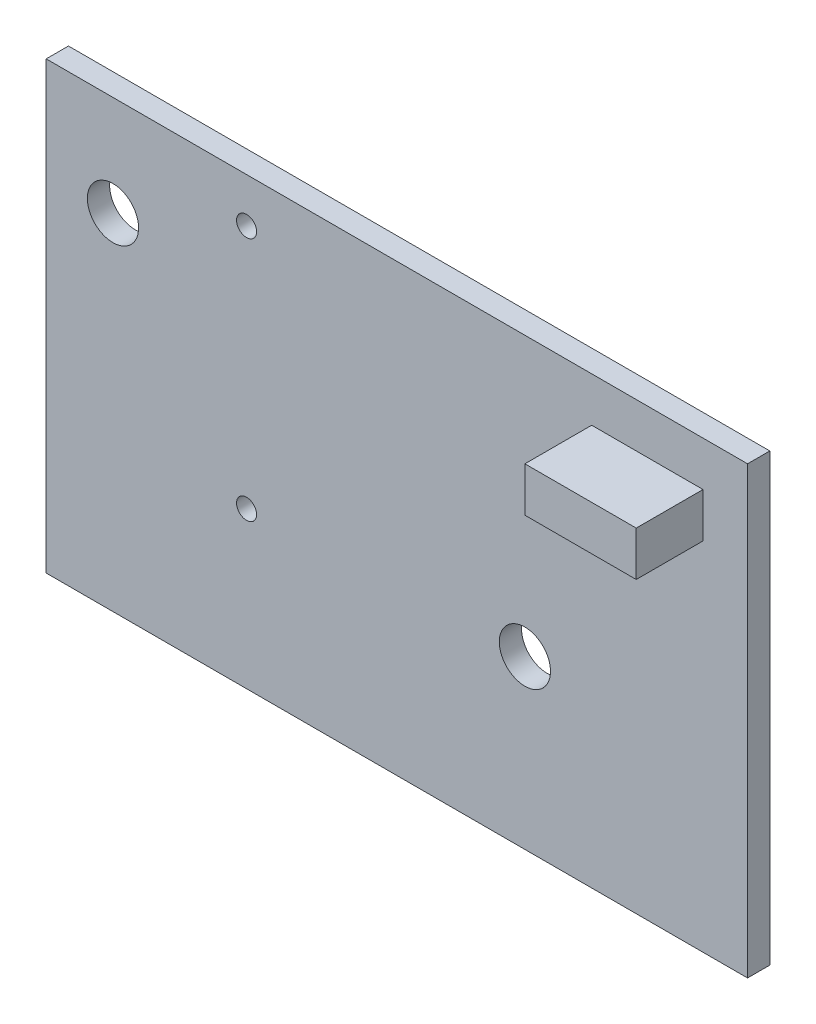
ISO-10303-21;
HEADER;
FILE_DESCRIPTION(('STEP AP214'),'2;1');
FILE_NAME('part.step','',(''),(''),'','','');
FILE_SCHEMA(('AUTOMOTIVE_DESIGN { 1 0 10303 214 1 1 1 1 }'));
ENDSEC;
DATA;
#1=APPLICATION_CONTEXT('core data for automotive mechanical design processes');
#2=APPLICATION_PROTOCOL_DEFINITION('international standard','automotive_design',2000,#1);
#3=PRODUCT_CONTEXT('',#1,'mechanical');
#4=PRODUCT('Part','Part','',(#3));
#5=PRODUCT_RELATED_PRODUCT_CATEGORY('part','',(#4));
#6=PRODUCT_DEFINITION_FORMATION('','',#4);
#7=PRODUCT_DEFINITION_CONTEXT('part definition',#1,'design');
#8=PRODUCT_DEFINITION('design','',#6,#7);
#9=PRODUCT_DEFINITION_SHAPE('','',#8);
#10=(LENGTH_UNIT() NAMED_UNIT(*) SI_UNIT(.MILLI.,.METRE.));
#11=(NAMED_UNIT(*) PLANE_ANGLE_UNIT() SI_UNIT($,.RADIAN.));
#12=(NAMED_UNIT(*) SI_UNIT($,.STERADIAN.) SOLID_ANGLE_UNIT());
#13=UNCERTAINTY_MEASURE_WITH_UNIT(LENGTH_MEASURE(1.E-05),#10,'distance_accuracy_value','');
#14=(GEOMETRIC_REPRESENTATION_CONTEXT(3) GLOBAL_UNCERTAINTY_ASSIGNED_CONTEXT((#13)) GLOBAL_UNIT_ASSIGNED_CONTEXT((#10,
#11,#12)) REPRESENTATION_CONTEXT('',''));
#15=CARTESIAN_POINT('',(0.,0.,0.));
#16=DIRECTION('',(0.,0.,1.));
#17=DIRECTION('',(1.,0.,0.));
#18=AXIS2_PLACEMENT_3D('',#15,#16,#17);
#19=CARTESIAN_POINT('',(0.,20.,1.));
#20=DIRECTION('',(0.,0.,-1.));
#21=DIRECTION('',(-1.,0.,0.));
#22=AXIS2_PLACEMENT_3D('',#19,#20,#21);
#23=PLANE('',#22);
#24=CARTESIAN_POINT('',(9.,7.,1.));
#25=DIRECTION('',(0.,0.,1.));
#26=DIRECTION('',(1.,0.,0.));
#27=AXIS2_PLACEMENT_3D('',#24,#25,#26);
#28=CIRCLE('',#27,0.45);
#29=CARTESIAN_POINT('',(9.45,7.,1.));
#30=VERTEX_POINT('',#29);
#31=EDGE_CURVE('E119',#30,#30,#28,.T.);
#32=ORIENTED_EDGE('',*,*,#31,.F.);
#33=EDGE_LOOP('',(#32));
#34=FACE_BOUND('',#33,.T.);
#35=CARTESIAN_POINT('',(21.5,7.5,1.));
#36=DIRECTION('',(0.,0.,1.));
#37=DIRECTION('',(1.,0.,0.));
#38=AXIS2_PLACEMENT_3D('',#35,#36,#37);
#39=CIRCLE('',#38,1.15);
#40=CARTESIAN_POINT('',(22.65,7.5,1.));
#41=VERTEX_POINT('',#40);
#42=EDGE_CURVE('E134',#41,#41,#39,.T.);
#43=ORIENTED_EDGE('',*,*,#42,.F.);
#44=EDGE_LOOP('',(#43));
#45=FACE_BOUND('',#44,.T.);
#46=DIRECTION('',(0.,-1.,0.));
#47=VECTOR('',#46,1.);
#48=CARTESIAN_POINT('',(0.,0.,1.));
#49=LINE('',#48,#47);
#50=CARTESIAN_POINT('',(0.,20.,1.));
#51=VERTEX_POINT('',#50);
#52=CARTESIAN_POINT('',(0.,0.,1.));
#53=VERTEX_POINT('',#52);
#54=EDGE_CURVE('E146',#51,#53,#49,.T.);
#55=ORIENTED_EDGE('',*,*,#54,.T.);
#56=DIRECTION('',(1.,0.,0.));
#57=VECTOR('',#56,1.);
#58=CARTESIAN_POINT('',(0.,0.,1.));
#59=LINE('',#58,#57);
#60=CARTESIAN_POINT('',(31.5,0.,1.));
#61=VERTEX_POINT('',#60);
#62=EDGE_CURVE('E149',#53,#61,#59,.T.);
#63=ORIENTED_EDGE('',*,*,#62,.T.);
#64=DIRECTION('',(0.,1.,0.));
#65=VECTOR('',#64,1.);
#66=CARTESIAN_POINT('',(31.5,0.,1.));
#67=LINE('',#66,#65);
#68=CARTESIAN_POINT('',(31.5,20.,1.));
#69=VERTEX_POINT('',#68);
#70=EDGE_CURVE('E152',#61,#69,#67,.T.);
#71=ORIENTED_EDGE('',*,*,#70,.T.);
#72=DIRECTION('',(-1.,0.,0.));
#73=VECTOR('',#72,1.);
#74=CARTESIAN_POINT('',(0.,20.,1.));
#75=LINE('',#74,#73);
#76=EDGE_CURVE('E154',#69,#51,#75,.T.);
#77=ORIENTED_EDGE('',*,*,#76,.T.);
#78=EDGE_LOOP('',(#55,#63,#71,#77));
#79=FACE_BOUND('',#78,.T.);
#80=CARTESIAN_POINT('',(3.,15.5,1.));
#81=DIRECTION('',(0.,0.,1.));
#82=DIRECTION('',(1.,0.,0.));
#83=AXIS2_PLACEMENT_3D('',#80,#81,#82);
#84=CIRCLE('',#83,1.15);
#85=CARTESIAN_POINT('',(4.15,15.5,1.));
#86=VERTEX_POINT('',#85);
#87=EDGE_CURVE('E140',#86,#86,#84,.T.);
#88=ORIENTED_EDGE('',*,*,#87,.F.);
#89=EDGE_LOOP('',(#88));
#90=FACE_BOUND('',#89,.T.);
#91=CARTESIAN_POINT('',(9.,18.,1.));
#92=DIRECTION('',(0.,0.,1.));
#93=DIRECTION('',(1.,0.,0.));
#94=AXIS2_PLACEMENT_3D('',#91,#92,#93);
#95=CIRCLE('',#94,0.449999999999998);
#96=CARTESIAN_POINT('',(9.45,18.,1.));
#97=VERTEX_POINT('',#96);
#98=EDGE_CURVE('E128',#97,#97,#95,.T.);
#99=ORIENTED_EDGE('',*,*,#98,.F.);
#100=EDGE_LOOP('',(#99));
#101=FACE_BOUND('',#100,.T.);
#102=DIRECTION('',(0.,-1.,0.));
#103=VECTOR('',#102,1.);
#104=CARTESIAN_POINT('',(24.5,18.,1.));
#105=LINE('',#104,#103);
#106=CARTESIAN_POINT('',(24.5,18.,1.));
#107=VERTEX_POINT('',#106);
#108=CARTESIAN_POINT('',(24.5,16.,1.));
#109=VERTEX_POINT('',#108);
#110=EDGE_CURVE('E115',#107,#109,#105,.T.);
#111=ORIENTED_EDGE('',*,*,#110,.F.);
#112=DIRECTION('',(-1.,0.,0.));
#113=VECTOR('',#112,1.);
#114=CARTESIAN_POINT('',(24.5,18.,1.));
#115=LINE('',#114,#113);
#116=CARTESIAN_POINT('',(29.5,18.,1.));
#117=VERTEX_POINT('',#116);
#118=EDGE_CURVE('E112',#117,#107,#115,.T.);
#119=ORIENTED_EDGE('',*,*,#118,.F.);
#120=DIRECTION('',(0.,1.,0.));
#121=VECTOR('',#120,1.);
#122=CARTESIAN_POINT('',(29.5,18.,1.));
#123=LINE('',#122,#121);
#124=CARTESIAN_POINT('',(29.5,16.,1.));
#125=VERTEX_POINT('',#124);
#126=EDGE_CURVE('E50',#125,#117,#123,.T.);
#127=ORIENTED_EDGE('',*,*,#126,.F.);
#128=DIRECTION('',(1.,0.,0.));
#129=VECTOR('',#128,1.);
#130=CARTESIAN_POINT('',(24.5,16.,1.));
#131=LINE('',#130,#129);
#132=EDGE_CURVE('E45',#109,#125,#131,.T.);
#133=ORIENTED_EDGE('',*,*,#132,.F.);
#134=EDGE_LOOP('',(#111,#119,#127,#133));
#135=FACE_BOUND('',#134,.T.);
#136=ADVANCED_FACE('F30',(#34,#45,#79,#90,#101,#135),#23,.F.);
#137=CARTESIAN_POINT('',(0.,20.,0.));
#138=DIRECTION('',(0.,0.,-1.));
#139=DIRECTION('',(-1.,0.,0.));
#140=AXIS2_PLACEMENT_3D('',#137,#138,#139);
#141=PLANE('',#140);
#142=CARTESIAN_POINT('',(9.,18.,0.));
#143=DIRECTION('',(0.,0.,1.));
#144=DIRECTION('',(1.,0.,0.));
#145=AXIS2_PLACEMENT_3D('',#142,#143,#144);
#146=CIRCLE('',#145,0.449999999999998);
#147=CARTESIAN_POINT('',(9.45,18.,0.));
#148=VERTEX_POINT('',#147);
#149=EDGE_CURVE('E126',#148,#148,#146,.T.);
#150=ORIENTED_EDGE('',*,*,#149,.T.);
#151=EDGE_LOOP('',(#150));
#152=FACE_BOUND('',#151,.T.);
#153=CARTESIAN_POINT('',(3.,15.5,0.));
#154=DIRECTION('',(0.,0.,1.));
#155=DIRECTION('',(1.,0.,0.));
#156=AXIS2_PLACEMENT_3D('',#153,#154,#155);
#157=CIRCLE('',#156,1.15);
#158=CARTESIAN_POINT('',(4.15,15.5,0.));
#159=VERTEX_POINT('',#158);
#160=EDGE_CURVE('E137',#159,#159,#157,.T.);
#161=ORIENTED_EDGE('',*,*,#160,.T.);
#162=EDGE_LOOP('',(#161));
#163=FACE_BOUND('',#162,.T.);
#164=DIRECTION('',(0.,-1.,0.));
#165=VECTOR('',#164,1.);
#166=CARTESIAN_POINT('',(0.,0.,0.));
#167=LINE('',#166,#165);
#168=CARTESIAN_POINT('',(0.,20.,0.));
#169=VERTEX_POINT('',#168);
#170=CARTESIAN_POINT('',(0.,0.,0.));
#171=VERTEX_POINT('',#170);
#172=EDGE_CURVE('E143',#169,#171,#167,.T.);
#173=ORIENTED_EDGE('',*,*,#172,.F.);
#174=DIRECTION('',(-1.,0.,0.));
#175=VECTOR('',#174,1.);
#176=CARTESIAN_POINT('',(0.,20.,0.));
#177=LINE('',#176,#175);
#178=CARTESIAN_POINT('',(31.5,20.,0.));
#179=VERTEX_POINT('',#178);
#180=EDGE_CURVE('E150',#179,#169,#177,.T.);
#181=ORIENTED_EDGE('',*,*,#180,.F.);
#182=DIRECTION('',(0.,1.,0.));
#183=VECTOR('',#182,1.);
#184=CARTESIAN_POINT('',(31.5,0.,0.));
#185=LINE('',#184,#183);
#186=CARTESIAN_POINT('',(31.5,0.,0.));
#187=VERTEX_POINT('',#186);
#188=EDGE_CURVE('E161',#187,#179,#185,.T.);
#189=ORIENTED_EDGE('',*,*,#188,.F.);
#190=DIRECTION('',(1.,0.,0.));
#191=VECTOR('',#190,1.);
#192=CARTESIAN_POINT('',(0.,0.,0.));
#193=LINE('',#192,#191);
#194=EDGE_CURVE('E159',#171,#187,#193,.T.);
#195=ORIENTED_EDGE('',*,*,#194,.F.);
#196=EDGE_LOOP('',(#173,#181,#189,#195));
#197=FACE_BOUND('',#196,.T.);
#198=CARTESIAN_POINT('',(21.5,7.5,0.));
#199=DIRECTION('',(0.,0.,1.));
#200=DIRECTION('',(1.,0.,0.));
#201=AXIS2_PLACEMENT_3D('',#198,#199,#200);
#202=CIRCLE('',#201,1.15);
#203=CARTESIAN_POINT('',(22.65,7.5,0.));
#204=VERTEX_POINT('',#203);
#205=EDGE_CURVE('E131',#204,#204,#202,.T.);
#206=ORIENTED_EDGE('',*,*,#205,.T.);
#207=EDGE_LOOP('',(#206));
#208=FACE_BOUND('',#207,.T.);
#209=CARTESIAN_POINT('',(9.,7.,0.));
#210=DIRECTION('',(0.,0.,1.));
#211=DIRECTION('',(1.,0.,0.));
#212=AXIS2_PLACEMENT_3D('',#209,#210,#211);
#213=CIRCLE('',#212,0.45);
#214=CARTESIAN_POINT('',(9.45,7.,0.));
#215=VERTEX_POINT('',#214);
#216=EDGE_CURVE('E116',#215,#215,#213,.T.);
#217=ORIENTED_EDGE('',*,*,#216,.T.);
#218=EDGE_LOOP('',(#217));
#219=FACE_BOUND('',#218,.T.);
#220=ADVANCED_FACE('F179',(#152,#163,#197,#208,#219),#141,.T.);
#221=CARTESIAN_POINT('',(0.,0.,1.));
#222=DIRECTION('',(1.,0.,0.));
#223=DIRECTION('',(0.,0.,-1.));
#224=AXIS2_PLACEMENT_3D('',#221,#222,#223);
#225=PLANE('',#224);
#226=ORIENTED_EDGE('',*,*,#172,.T.);
#227=DIRECTION('',(0.,0.,-1.));
#228=VECTOR('',#227,1.);
#229=CARTESIAN_POINT('',(0.,0.,1.));
#230=LINE('',#229,#228);
#231=EDGE_CURVE('E11',#53,#171,#230,.T.);
#232=ORIENTED_EDGE('',*,*,#231,.F.);
#233=ORIENTED_EDGE('',*,*,#54,.F.);
#234=DIRECTION('',(0.,0.,-1.));
#235=VECTOR('',#234,1.);
#236=CARTESIAN_POINT('',(0.,20.,1.));
#237=LINE('',#236,#235);
#238=EDGE_CURVE('E156',#51,#169,#237,.T.);
#239=ORIENTED_EDGE('',*,*,#238,.T.);
#240=EDGE_LOOP('',(#226,#232,#233,#239));
#241=FACE_BOUND('',#240,.T.);
#242=ADVANCED_FACE('F32',(#241),#225,.F.);
#243=CARTESIAN_POINT('',(0.,0.,1.));
#244=DIRECTION('',(0.,1.,0.));
#245=DIRECTION('',(0.,0.,1.));
#246=AXIS2_PLACEMENT_3D('',#243,#244,#245);
#247=PLANE('',#246);
#248=ORIENTED_EDGE('',*,*,#194,.T.);
#249=DIRECTION('',(0.,0.,-1.));
#250=VECTOR('',#249,1.);
#251=CARTESIAN_POINT('',(31.5,0.,1.));
#252=LINE('',#251,#250);
#253=EDGE_CURVE('E38',#61,#187,#252,.T.);
#254=ORIENTED_EDGE('',*,*,#253,.F.);
#255=ORIENTED_EDGE('',*,*,#62,.F.);
#256=ORIENTED_EDGE('',*,*,#231,.T.);
#257=EDGE_LOOP('',(#248,#254,#255,#256));
#258=FACE_BOUND('',#257,.T.);
#259=ADVANCED_FACE('F190',(#258),#247,.F.);
#260=CARTESIAN_POINT('',(31.5,0.,1.));
#261=DIRECTION('',(-1.,0.,0.));
#262=DIRECTION('',(0.,0.,1.));
#263=AXIS2_PLACEMENT_3D('',#260,#261,#262);
#264=PLANE('',#263);
#265=ORIENTED_EDGE('',*,*,#188,.T.);
#266=DIRECTION('',(0.,0.,-1.));
#267=VECTOR('',#266,1.);
#268=CARTESIAN_POINT('',(31.5,20.,1.));
#269=LINE('',#268,#267);
#270=EDGE_CURVE('E166',#69,#179,#269,.T.);
#271=ORIENTED_EDGE('',*,*,#270,.F.);
#272=ORIENTED_EDGE('',*,*,#70,.F.);
#273=ORIENTED_EDGE('',*,*,#253,.T.);
#274=EDGE_LOOP('',(#265,#271,#272,#273));
#275=FACE_BOUND('',#274,.T.);
#276=ADVANCED_FACE('F173',(#275),#264,.F.);
#277=CARTESIAN_POINT('',(0.,20.,1.));
#278=DIRECTION('',(0.,-1.,0.));
#279=DIRECTION('',(0.,0.,-1.));
#280=AXIS2_PLACEMENT_3D('',#277,#278,#279);
#281=PLANE('',#280);
#282=ORIENTED_EDGE('',*,*,#180,.T.);
#283=ORIENTED_EDGE('',*,*,#238,.F.);
#284=ORIENTED_EDGE('',*,*,#76,.F.);
#285=ORIENTED_EDGE('',*,*,#270,.T.);
#286=EDGE_LOOP('',(#282,#283,#284,#285));
#287=FACE_BOUND('',#286,.T.);
#288=ADVANCED_FACE('F183',(#287),#281,.F.);
#289=CARTESIAN_POINT('',(3.,15.5,1.));
#290=DIRECTION('',(0.,0.,-1.));
#291=DIRECTION('',(-1.,0.,0.));
#292=AXIS2_PLACEMENT_3D('',#289,#290,#291);
#293=CYLINDRICAL_SURFACE('',#292,1.15);
#294=ORIENTED_EDGE('',*,*,#87,.T.);
#295=EDGE_LOOP('',(#294));
#296=FACE_BOUND('',#295,.T.);
#297=ORIENTED_EDGE('',*,*,#160,.F.);
#298=EDGE_LOOP('',(#297));
#299=FACE_BOUND('',#298,.T.);
#300=ADVANCED_FACE('F208',(#296,#299),#293,.F.);
#301=CARTESIAN_POINT('',(21.5,7.5,1.));
#302=DIRECTION('',(0.,0.,-1.));
#303=DIRECTION('',(-1.,0.,0.));
#304=AXIS2_PLACEMENT_3D('',#301,#302,#303);
#305=CYLINDRICAL_SURFACE('',#304,1.15);
#306=ORIENTED_EDGE('',*,*,#42,.T.);
#307=EDGE_LOOP('',(#306));
#308=FACE_BOUND('',#307,.T.);
#309=ORIENTED_EDGE('',*,*,#205,.F.);
#310=EDGE_LOOP('',(#309));
#311=FACE_BOUND('',#310,.T.);
#312=ADVANCED_FACE('F215',(#308,#311),#305,.F.);
#313=CARTESIAN_POINT('',(9.,18.,1.));
#314=DIRECTION('',(0.,0.,-1.));
#315=DIRECTION('',(-1.,0.,0.));
#316=AXIS2_PLACEMENT_3D('',#313,#314,#315);
#317=CYLINDRICAL_SURFACE('',#316,0.449999999999998);
#318=ORIENTED_EDGE('',*,*,#98,.T.);
#319=EDGE_LOOP('',(#318));
#320=FACE_BOUND('',#319,.T.);
#321=ORIENTED_EDGE('',*,*,#149,.F.);
#322=EDGE_LOOP('',(#321));
#323=FACE_BOUND('',#322,.T.);
#324=ADVANCED_FACE('F220',(#320,#323),#317,.F.);
#325=CARTESIAN_POINT('',(9.,7.,1.));
#326=DIRECTION('',(0.,0.,-1.));
#327=DIRECTION('',(-1.,0.,0.));
#328=AXIS2_PLACEMENT_3D('',#325,#326,#327);
#329=CYLINDRICAL_SURFACE('',#328,0.45);
#330=ORIENTED_EDGE('',*,*,#31,.T.);
#331=EDGE_LOOP('',(#330));
#332=FACE_BOUND('',#331,.T.);
#333=ORIENTED_EDGE('',*,*,#216,.F.);
#334=EDGE_LOOP('',(#333));
#335=FACE_BOUND('',#334,.T.);
#336=ADVANCED_FACE('F255',(#332,#335),#329,.F.);
#337=CARTESIAN_POINT('',(24.5,18.,4.));
#338=DIRECTION('',(1.,0.,0.));
#339=DIRECTION('',(0.,0.,-1.));
#340=AXIS2_PLACEMENT_3D('',#337,#338,#339);
#341=PLANE('',#340);
#342=ORIENTED_EDGE('',*,*,#110,.T.);
#343=DIRECTION('',(0.,0.,-1.));
#344=VECTOR('',#343,1.);
#345=CARTESIAN_POINT('',(24.5,16.,4.));
#346=LINE('',#345,#344);
#347=CARTESIAN_POINT('',(24.5,16.,4.));
#348=VERTEX_POINT('',#347);
#349=EDGE_CURVE('E96',#348,#109,#346,.T.);
#350=ORIENTED_EDGE('',*,*,#349,.F.);
#351=DIRECTION('',(0.,-1.,0.));
#352=VECTOR('',#351,1.);
#353=CARTESIAN_POINT('',(24.5,18.,4.));
#354=LINE('',#353,#352);
#355=CARTESIAN_POINT('',(24.5,18.,4.));
#356=VERTEX_POINT('',#355);
#357=EDGE_CURVE('E103',#356,#348,#354,.T.);
#358=ORIENTED_EDGE('',*,*,#357,.F.);
#359=DIRECTION('',(0.,0.,-1.));
#360=VECTOR('',#359,1.);
#361=CARTESIAN_POINT('',(24.5,18.,4.));
#362=LINE('',#361,#360);
#363=EDGE_CURVE('E233',#356,#107,#362,.T.);
#364=ORIENTED_EDGE('',*,*,#363,.T.);
#365=EDGE_LOOP('',(#342,#350,#358,#364));
#366=FACE_BOUND('',#365,.T.);
#367=ADVANCED_FACE('F114',(#366),#341,.F.);
#368=CARTESIAN_POINT('',(24.5,16.,4.));
#369=DIRECTION('',(0.,1.,0.));
#370=DIRECTION('',(0.,0.,1.));
#371=AXIS2_PLACEMENT_3D('',#368,#369,#370);
#372=PLANE('',#371);
#373=ORIENTED_EDGE('',*,*,#132,.T.);
#374=DIRECTION('',(0.,0.,-1.));
#375=VECTOR('',#374,1.);
#376=CARTESIAN_POINT('',(29.5,16.,4.));
#377=LINE('',#376,#375);
#378=CARTESIAN_POINT('',(29.5,16.,4.));
#379=VERTEX_POINT('',#378);
#380=EDGE_CURVE('E99',#379,#125,#377,.T.);
#381=ORIENTED_EDGE('',*,*,#380,.F.);
#382=DIRECTION('',(1.,0.,0.));
#383=VECTOR('',#382,1.);
#384=CARTESIAN_POINT('',(24.5,16.,4.));
#385=LINE('',#384,#383);
#386=EDGE_CURVE('E92',#348,#379,#385,.T.);
#387=ORIENTED_EDGE('',*,*,#386,.F.);
#388=ORIENTED_EDGE('',*,*,#349,.T.);
#389=EDGE_LOOP('',(#373,#381,#387,#388));
#390=FACE_BOUND('',#389,.T.);
#391=ADVANCED_FACE('F94',(#390),#372,.F.);
#392=CARTESIAN_POINT('',(29.5,18.,4.));
#393=DIRECTION('',(-1.,0.,0.));
#394=DIRECTION('',(0.,0.,1.));
#395=AXIS2_PLACEMENT_3D('',#392,#393,#394);
#396=PLANE('',#395);
#397=ORIENTED_EDGE('',*,*,#126,.T.);
#398=DIRECTION('',(0.,0.,-1.));
#399=VECTOR('',#398,1.);
#400=CARTESIAN_POINT('',(29.5,18.,4.));
#401=LINE('',#400,#399);
#402=CARTESIAN_POINT('',(29.5,18.,4.));
#403=VERTEX_POINT('',#402);
#404=EDGE_CURVE('E121',#403,#117,#401,.T.);
#405=ORIENTED_EDGE('',*,*,#404,.F.);
#406=DIRECTION('',(0.,1.,0.));
#407=VECTOR('',#406,1.);
#408=CARTESIAN_POINT('',(29.5,18.,4.));
#409=LINE('',#408,#407);
#410=EDGE_CURVE('E102',#379,#403,#409,.T.);
#411=ORIENTED_EDGE('',*,*,#410,.F.);
#412=ORIENTED_EDGE('',*,*,#380,.T.);
#413=EDGE_LOOP('',(#397,#405,#411,#412));
#414=FACE_BOUND('',#413,.T.);
#415=ADVANCED_FACE('F242',(#414),#396,.F.);
#416=CARTESIAN_POINT('',(24.5,18.,4.));
#417=DIRECTION('',(0.,-1.,0.));
#418=DIRECTION('',(0.,0.,-1.));
#419=AXIS2_PLACEMENT_3D('',#416,#417,#418);
#420=PLANE('',#419);
#421=ORIENTED_EDGE('',*,*,#118,.T.);
#422=ORIENTED_EDGE('',*,*,#363,.F.);
#423=DIRECTION('',(-1.,0.,0.));
#424=VECTOR('',#423,1.);
#425=CARTESIAN_POINT('',(24.5,18.,4.));
#426=LINE('',#425,#424);
#427=EDGE_CURVE('E108',#403,#356,#426,.T.);
#428=ORIENTED_EDGE('',*,*,#427,.F.);
#429=ORIENTED_EDGE('',*,*,#404,.T.);
#430=EDGE_LOOP('',(#421,#422,#428,#429));
#431=FACE_BOUND('',#430,.T.);
#432=ADVANCED_FACE('F232',(#431),#420,.F.);
#433=CARTESIAN_POINT('',(24.5,16.,4.));
#434=DIRECTION('',(0.,0.,1.));
#435=DIRECTION('',(1.,0.,0.));
#436=AXIS2_PLACEMENT_3D('',#433,#434,#435);
#437=PLANE('',#436);
#438=ORIENTED_EDGE('',*,*,#357,.T.);
#439=ORIENTED_EDGE('',*,*,#386,.T.);
#440=ORIENTED_EDGE('',*,*,#410,.T.);
#441=ORIENTED_EDGE('',*,*,#427,.T.);
#442=EDGE_LOOP('',(#438,#439,#440,#441));
#443=FACE_BOUND('',#442,.T.);
#444=ADVANCED_FACE('F106',(#443),#437,.T.);
#445=CLOSED_SHELL('',(#136,#220,#242,#259,#276,#288,#300,#312,#324,#336,#367,#391,#415,#432,#444));
#446=MANIFOLD_SOLID_BREP('B2',#445);
#447=ADVANCED_BREP_SHAPE_REPRESENTATION('',(#18,#446),#14);
#448=SHAPE_DEFINITION_REPRESENTATION(#9,#447);
ENDSEC;
END-ISO-10303-21;
